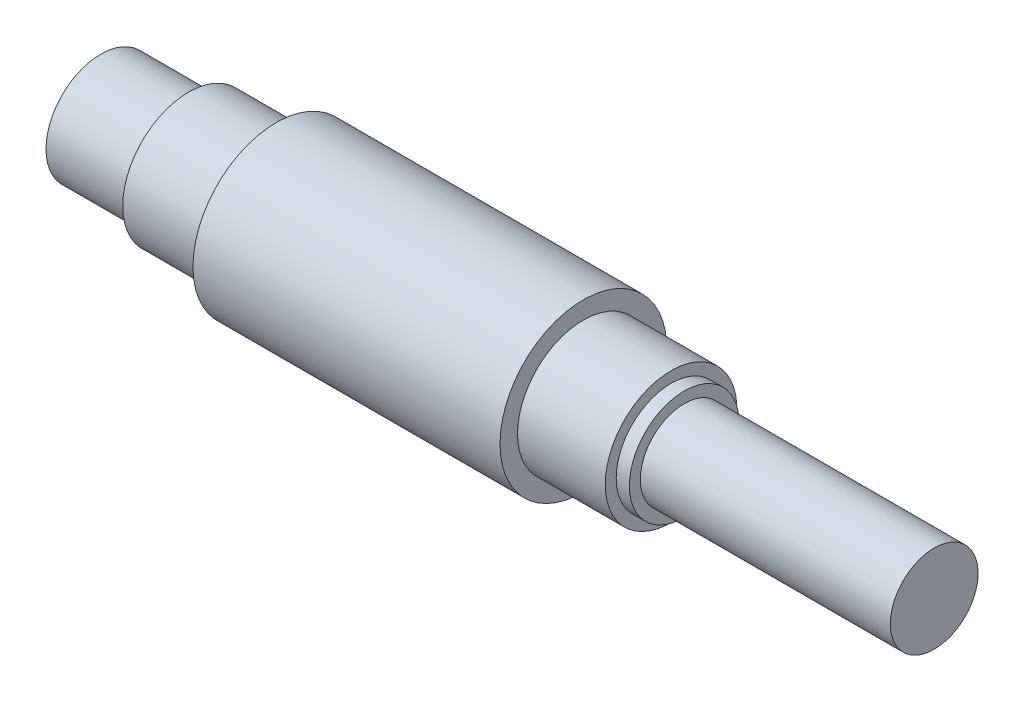
ISO-10303-21;
HEADER;
FILE_DESCRIPTION(('STEP AP214'),'2;1');
FILE_NAME('part.step','',(''),(''),'','','');
FILE_SCHEMA(('AUTOMOTIVE_DESIGN { 1 0 10303 214 1 1 1 1 }'));
ENDSEC;
DATA;
#1=APPLICATION_CONTEXT('core data for automotive mechanical design processes');
#2=APPLICATION_PROTOCOL_DEFINITION('international standard','automotive_design',2000,#1);
#3=PRODUCT_CONTEXT('',#1,'mechanical');
#4=PRODUCT('Part','Part','',(#3));
#5=PRODUCT_RELATED_PRODUCT_CATEGORY('part','',(#4));
#6=PRODUCT_DEFINITION_FORMATION('','',#4);
#7=PRODUCT_DEFINITION_CONTEXT('part definition',#1,'design');
#8=PRODUCT_DEFINITION('design','',#6,#7);
#9=PRODUCT_DEFINITION_SHAPE('','',#8);
#10=(LENGTH_UNIT() NAMED_UNIT(*) SI_UNIT(.MILLI.,.METRE.));
#11=(NAMED_UNIT(*) PLANE_ANGLE_UNIT() SI_UNIT($,.RADIAN.));
#12=(NAMED_UNIT(*) SI_UNIT($,.STERADIAN.) SOLID_ANGLE_UNIT());
#13=UNCERTAINTY_MEASURE_WITH_UNIT(LENGTH_MEASURE(1.E-05),#10,'distance_accuracy_value','');
#14=(GEOMETRIC_REPRESENTATION_CONTEXT(3) GLOBAL_UNCERTAINTY_ASSIGNED_CONTEXT((#13)) GLOBAL_UNIT_ASSIGNED_CONTEXT((#10,
#11,#12)) REPRESENTATION_CONTEXT('',''));
#15=CARTESIAN_POINT('',(0.,0.,0.));
#16=DIRECTION('',(0.,0.,1.));
#17=DIRECTION('',(1.,0.,0.));
#18=AXIS2_PLACEMENT_3D('',#15,#16,#17);
#19=CARTESIAN_POINT('',(0.,12.5,0.));
#20=DIRECTION('',(1.,0.,0.));
#21=DIRECTION('',(0.,0.,-1.));
#22=AXIS2_PLACEMENT_3D('',#19,#20,#21);
#23=PLANE('',#22);
#24=CARTESIAN_POINT('',(0.,0.,0.));
#25=DIRECTION('',(-1.,0.,0.));
#26=DIRECTION('',(0.,0.,1.));
#27=AXIS2_PLACEMENT_3D('',#24,#25,#26);
#28=CIRCLE('',#27,12.5);
#29=CARTESIAN_POINT('',(0.,0.,12.5));
#30=VERTEX_POINT('',#29);
#31=EDGE_CURVE('E10',#30,#30,#28,.T.);
#32=ORIENTED_EDGE('',*,*,#31,.T.);
#33=EDGE_LOOP('',(#32));
#34=FACE_BOUND('',#33,.T.);
#35=ADVANCED_FACE('F39',(#34),#23,.F.);
#36=CARTESIAN_POINT('',(0.,0.,0.));
#37=DIRECTION('',(-1.,0.,0.));
#38=DIRECTION('',(0.,0.,1.));
#39=AXIS2_PLACEMENT_3D('',#36,#37,#38);
#40=CYLINDRICAL_SURFACE('',#39,12.5);
#41=ORIENTED_EDGE('',*,*,#31,.F.);
#42=EDGE_LOOP('',(#41));
#43=FACE_BOUND('',#42,.T.);
#44=CARTESIAN_POINT('',(20.,0.,0.));
#45=DIRECTION('',(-1.,0.,0.));
#46=DIRECTION('',(0.,0.,1.));
#47=AXIS2_PLACEMENT_3D('',#44,#45,#46);
#48=CIRCLE('',#47,12.5);
#49=CARTESIAN_POINT('',(20.,0.,12.5));
#50=VERTEX_POINT('',#49);
#51=EDGE_CURVE('E45',#50,#50,#48,.T.);
#52=ORIENTED_EDGE('',*,*,#51,.T.);
#53=EDGE_LOOP('',(#52));
#54=FACE_BOUND('',#53,.T.);
#55=ADVANCED_FACE('F95',(#43,#54),#40,.T.);
#56=CARTESIAN_POINT('',(20.,15.,0.));
#57=DIRECTION('',(1.,0.,0.));
#58=DIRECTION('',(0.,0.,-1.));
#59=AXIS2_PLACEMENT_3D('',#56,#57,#58);
#60=PLANE('',#59);
#61=ORIENTED_EDGE('',*,*,#51,.F.);
#62=EDGE_LOOP('',(#61));
#63=FACE_BOUND('',#62,.T.);
#64=CARTESIAN_POINT('',(20.,0.,0.));
#65=DIRECTION('',(-1.,0.,0.));
#66=DIRECTION('',(0.,0.,1.));
#67=AXIS2_PLACEMENT_3D('',#64,#65,#66);
#68=CIRCLE('',#67,15.);
#69=CARTESIAN_POINT('',(20.,0.,15.));
#70=VERTEX_POINT('',#69);
#71=EDGE_CURVE('E49',#70,#70,#68,.T.);
#72=ORIENTED_EDGE('',*,*,#71,.T.);
#73=EDGE_LOOP('',(#72));
#74=FACE_BOUND('',#73,.T.);
#75=ADVANCED_FACE('F99',(#63,#74),#60,.F.);
#76=CARTESIAN_POINT('',(0.,0.,0.));
#77=DIRECTION('',(-1.,0.,0.));
#78=DIRECTION('',(0.,0.,1.));
#79=AXIS2_PLACEMENT_3D('',#76,#77,#78);
#80=CYLINDRICAL_SURFACE('',#79,15.);
#81=ORIENTED_EDGE('',*,*,#71,.F.);
#82=EDGE_LOOP('',(#81));
#83=FACE_BOUND('',#82,.T.);
#84=CARTESIAN_POINT('',(40.,0.,0.));
#85=DIRECTION('',(-1.,0.,0.));
#86=DIRECTION('',(0.,0.,1.));
#87=AXIS2_PLACEMENT_3D('',#84,#85,#86);
#88=CIRCLE('',#87,15.);
#89=CARTESIAN_POINT('',(40.,0.,15.));
#90=VERTEX_POINT('',#89);
#91=EDGE_CURVE('E53',#90,#90,#88,.T.);
#92=ORIENTED_EDGE('',*,*,#91,.T.);
#93=EDGE_LOOP('',(#92));
#94=FACE_BOUND('',#93,.T.);
#95=ADVANCED_FACE('F104',(#83,#94),#80,.T.);
#96=CARTESIAN_POINT('',(40.,19.,0.));
#97=DIRECTION('',(1.,0.,0.));
#98=DIRECTION('',(0.,0.,-1.));
#99=AXIS2_PLACEMENT_3D('',#96,#97,#98);
#100=PLANE('',#99);
#101=ORIENTED_EDGE('',*,*,#91,.F.);
#102=EDGE_LOOP('',(#101));
#103=FACE_BOUND('',#102,.T.);
#104=CARTESIAN_POINT('',(40.,0.,0.));
#105=DIRECTION('',(-1.,0.,0.));
#106=DIRECTION('',(0.,0.,1.));
#107=AXIS2_PLACEMENT_3D('',#104,#105,#106);
#108=CIRCLE('',#107,19.);
#109=CARTESIAN_POINT('',(40.,0.,19.));
#110=VERTEX_POINT('',#109);
#111=EDGE_CURVE('E58',#110,#110,#108,.T.);
#112=ORIENTED_EDGE('',*,*,#111,.T.);
#113=EDGE_LOOP('',(#112));
#114=FACE_BOUND('',#113,.T.);
#115=ADVANCED_FACE('F110',(#103,#114),#100,.F.);
#116=CARTESIAN_POINT('',(0.,0.,0.));
#117=DIRECTION('',(-1.,0.,0.));
#118=DIRECTION('',(0.,0.,1.));
#119=AXIS2_PLACEMENT_3D('',#116,#117,#118);
#120=CYLINDRICAL_SURFACE('',#119,19.);
#121=ORIENTED_EDGE('',*,*,#111,.F.);
#122=EDGE_LOOP('',(#121));
#123=FACE_BOUND('',#122,.T.);
#124=CARTESIAN_POINT('',(110.,0.,0.));
#125=DIRECTION('',(-1.,0.,0.));
#126=DIRECTION('',(0.,0.,1.));
#127=AXIS2_PLACEMENT_3D('',#124,#125,#126);
#128=CIRCLE('',#127,19.);
#129=CARTESIAN_POINT('',(110.,0.,19.));
#130=VERTEX_POINT('',#129);
#131=EDGE_CURVE('E61',#130,#130,#128,.T.);
#132=ORIENTED_EDGE('',*,*,#131,.T.);
#133=EDGE_LOOP('',(#132));
#134=FACE_BOUND('',#133,.T.);
#135=ADVANCED_FACE('F114',(#123,#134),#120,.T.);
#136=CARTESIAN_POINT('',(110.,19.,0.));
#137=DIRECTION('',(-1.,0.,0.));
#138=DIRECTION('',(0.,0.,1.));
#139=AXIS2_PLACEMENT_3D('',#136,#137,#138);
#140=PLANE('',#139);
#141=ORIENTED_EDGE('',*,*,#131,.F.);
#142=EDGE_LOOP('',(#141));
#143=FACE_BOUND('',#142,.T.);
#144=CARTESIAN_POINT('',(110.,0.,0.));
#145=DIRECTION('',(-1.,0.,0.));
#146=DIRECTION('',(0.,0.,1.));
#147=AXIS2_PLACEMENT_3D('',#144,#145,#146);
#148=CIRCLE('',#147,15.);
#149=CARTESIAN_POINT('',(110.,0.,15.));
#150=VERTEX_POINT('',#149);
#151=EDGE_CURVE('E64',#150,#150,#148,.T.);
#152=ORIENTED_EDGE('',*,*,#151,.T.);
#153=EDGE_LOOP('',(#152));
#154=FACE_BOUND('',#153,.T.);
#155=ADVANCED_FACE('F118',(#143,#154),#140,.F.);
#156=CARTESIAN_POINT('',(0.,0.,0.));
#157=DIRECTION('',(-1.,0.,0.));
#158=DIRECTION('',(0.,0.,1.));
#159=AXIS2_PLACEMENT_3D('',#156,#157,#158);
#160=CYLINDRICAL_SURFACE('',#159,15.);
#161=ORIENTED_EDGE('',*,*,#151,.F.);
#162=EDGE_LOOP('',(#161));
#163=FACE_BOUND('',#162,.T.);
#164=CARTESIAN_POINT('',(130.,0.,0.));
#165=DIRECTION('',(-1.,0.,0.));
#166=DIRECTION('',(0.,0.,1.));
#167=AXIS2_PLACEMENT_3D('',#164,#165,#166);
#168=CIRCLE('',#167,15.);
#169=CARTESIAN_POINT('',(130.,0.,15.));
#170=VERTEX_POINT('',#169);
#171=EDGE_CURVE('E67',#170,#170,#168,.T.);
#172=ORIENTED_EDGE('',*,*,#171,.T.);
#173=EDGE_LOOP('',(#172));
#174=FACE_BOUND('',#173,.T.);
#175=ADVANCED_FACE('F122',(#163,#174),#160,.T.);
#176=CARTESIAN_POINT('',(130.,15.,0.));
#177=DIRECTION('',(-1.,0.,0.));
#178=DIRECTION('',(0.,0.,1.));
#179=AXIS2_PLACEMENT_3D('',#176,#177,#178);
#180=PLANE('',#179);
#181=ORIENTED_EDGE('',*,*,#171,.F.);
#182=EDGE_LOOP('',(#181));
#183=FACE_BOUND('',#182,.T.);
#184=CARTESIAN_POINT('',(130.,0.,0.));
#185=DIRECTION('',(-1.,0.,0.));
#186=DIRECTION('',(0.,0.,1.));
#187=AXIS2_PLACEMENT_3D('',#184,#185,#186);
#188=CIRCLE('',#187,12.5);
#189=CARTESIAN_POINT('',(130.,0.,12.5));
#190=VERTEX_POINT('',#189);
#191=EDGE_CURVE('E70',#190,#190,#188,.T.);
#192=ORIENTED_EDGE('',*,*,#191,.T.);
#193=EDGE_LOOP('',(#192));
#194=FACE_BOUND('',#193,.T.);
#195=ADVANCED_FACE('F126',(#183,#194),#180,.F.);
#196=CARTESIAN_POINT('',(0.,0.,0.));
#197=DIRECTION('',(-1.,0.,0.));
#198=DIRECTION('',(0.,0.,1.));
#199=AXIS2_PLACEMENT_3D('',#196,#197,#198);
#200=CYLINDRICAL_SURFACE('',#199,12.5);
#201=ORIENTED_EDGE('',*,*,#191,.F.);
#202=EDGE_LOOP('',(#201));
#203=FACE_BOUND('',#202,.T.);
#204=CARTESIAN_POINT('',(133.,0.,0.));
#205=DIRECTION('',(-1.,0.,0.));
#206=DIRECTION('',(0.,0.,1.));
#207=AXIS2_PLACEMENT_3D('',#204,#205,#206);
#208=CIRCLE('',#207,12.5);
#209=CARTESIAN_POINT('',(133.,0.,12.5));
#210=VERTEX_POINT('',#209);
#211=EDGE_CURVE('E73',#210,#210,#208,.T.);
#212=ORIENTED_EDGE('',*,*,#211,.T.);
#213=EDGE_LOOP('',(#212));
#214=FACE_BOUND('',#213,.T.);
#215=ADVANCED_FACE('F130',(#203,#214),#200,.T.);
#216=CARTESIAN_POINT('',(133.,12.5,0.));
#217=DIRECTION('',(-1.,0.,0.));
#218=DIRECTION('',(0.,0.,1.));
#219=AXIS2_PLACEMENT_3D('',#216,#217,#218);
#220=PLANE('',#219);
#221=ORIENTED_EDGE('',*,*,#211,.F.);
#222=EDGE_LOOP('',(#221));
#223=FACE_BOUND('',#222,.T.);
#224=CARTESIAN_POINT('',(133.,0.,0.));
#225=DIRECTION('',(-1.,0.,0.));
#226=DIRECTION('',(0.,0.,1.));
#227=AXIS2_PLACEMENT_3D('',#224,#225,#226);
#228=CIRCLE('',#227,10.);
#229=CARTESIAN_POINT('',(133.,0.,10.));
#230=VERTEX_POINT('',#229);
#231=EDGE_CURVE('E76',#230,#230,#228,.T.);
#232=ORIENTED_EDGE('',*,*,#231,.T.);
#233=EDGE_LOOP('',(#232));
#234=FACE_BOUND('',#233,.T.);
#235=ADVANCED_FACE('F91',(#223,#234),#220,.F.);
#236=CARTESIAN_POINT('',(0.,0.,0.));
#237=DIRECTION('',(-1.,0.,0.));
#238=DIRECTION('',(0.,0.,1.));
#239=AXIS2_PLACEMENT_3D('',#236,#237,#238);
#240=CYLINDRICAL_SURFACE('',#239,10.);
#241=ORIENTED_EDGE('',*,*,#231,.F.);
#242=EDGE_LOOP('',(#241));
#243=FACE_BOUND('',#242,.T.);
#244=CARTESIAN_POINT('',(190.,0.,0.));
#245=DIRECTION('',(-1.,0.,0.));
#246=DIRECTION('',(0.,0.,1.));
#247=AXIS2_PLACEMENT_3D('',#244,#245,#246);
#248=CIRCLE('',#247,10.);
#249=CARTESIAN_POINT('',(190.,0.,10.));
#250=VERTEX_POINT('',#249);
#251=EDGE_CURVE('E79',#250,#250,#248,.T.);
#252=ORIENTED_EDGE('',*,*,#251,.T.);
#253=EDGE_LOOP('',(#252));
#254=FACE_BOUND('',#253,.T.);
#255=ADVANCED_FACE('F83',(#243,#254),#240,.T.);
#256=CARTESIAN_POINT('',(190.,10.,0.));
#257=DIRECTION('',(-1.,0.,0.));
#258=DIRECTION('',(0.,0.,1.));
#259=AXIS2_PLACEMENT_3D('',#256,#257,#258);
#260=PLANE('',#259);
#261=ORIENTED_EDGE('',*,*,#251,.F.);
#262=EDGE_LOOP('',(#261));
#263=FACE_BOUND('',#262,.T.);
#264=ADVANCED_FACE('F85',(#263),#260,.F.);
#265=CLOSED_SHELL('',(#35,#55,#75,#95,#115,#135,#155,#175,#195,#215,#235,#255,#264));
#266=MANIFOLD_SOLID_BREP('B2',#265);
#267=ADVANCED_BREP_SHAPE_REPRESENTATION('',(#18,#266),#14);
#268=SHAPE_DEFINITION_REPRESENTATION(#9,#267);
ENDSEC;
END-ISO-10303-21;
